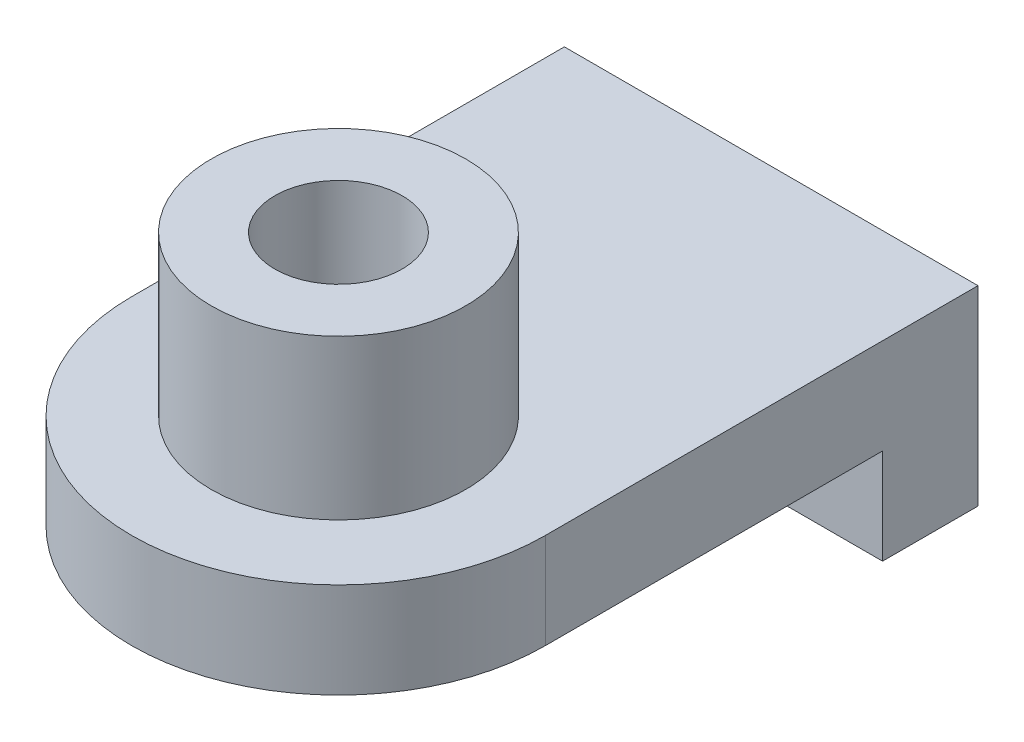
ISO-10303-21;
HEADER;
FILE_DESCRIPTION(('STEP AP214'),'2;1');
FILE_NAME('part.step','',(''),(''),'','','');
FILE_SCHEMA(('AUTOMOTIVE_DESIGN { 1 0 10303 214 1 1 1 1 }'));
ENDSEC;
DATA;
#1=APPLICATION_CONTEXT('core data for automotive mechanical design processes');
#2=APPLICATION_PROTOCOL_DEFINITION('international standard','automotive_design',2000,#1);
#3=PRODUCT_CONTEXT('',#1,'mechanical');
#4=PRODUCT('Part','Part','',(#3));
#5=PRODUCT_RELATED_PRODUCT_CATEGORY('part','',(#4));
#6=PRODUCT_DEFINITION_FORMATION('','',#4);
#7=PRODUCT_DEFINITION_CONTEXT('part definition',#1,'design');
#8=PRODUCT_DEFINITION('design','',#6,#7);
#9=PRODUCT_DEFINITION_SHAPE('','',#8);
#10=(LENGTH_UNIT() NAMED_UNIT(*) SI_UNIT(.MILLI.,.METRE.));
#11=(NAMED_UNIT(*) PLANE_ANGLE_UNIT() SI_UNIT($,.RADIAN.));
#12=(NAMED_UNIT(*) SI_UNIT($,.STERADIAN.) SOLID_ANGLE_UNIT());
#13=UNCERTAINTY_MEASURE_WITH_UNIT(LENGTH_MEASURE(1.E-05),#10,'distance_accuracy_value','');
#14=(GEOMETRIC_REPRESENTATION_CONTEXT(3) GLOBAL_UNCERTAINTY_ASSIGNED_CONTEXT((#13)) GLOBAL_UNIT_ASSIGNED_CONTEXT((#10,
#11,#12)) REPRESENTATION_CONTEXT('',''));
#15=CARTESIAN_POINT('',(0.,0.,0.));
#16=DIRECTION('',(0.,0.,1.));
#17=DIRECTION('',(1.,0.,0.));
#18=AXIS2_PLACEMENT_3D('',#15,#16,#17);
#19=CARTESIAN_POINT('',(0.,40.,0.));
#20=DIRECTION('',(0.,-1.,0.));
#21=DIRECTION('',(0.,0.,-1.));
#22=AXIS2_PLACEMENT_3D('',#19,#20,#21);
#23=CYLINDRICAL_SURFACE('',#22,10.);
#24=CARTESIAN_POINT('',(0.,40.,0.));
#25=DIRECTION('',(0.,1.,0.));
#26=DIRECTION('',(0.,0.,1.));
#27=AXIS2_PLACEMENT_3D('',#24,#25,#26);
#28=CIRCLE('',#27,10.);
#29=CARTESIAN_POINT('',(0.,40.,10.));
#30=VERTEX_POINT('',#29);
#31=EDGE_CURVE('E55',#30,#30,#28,.T.);
#32=ORIENTED_EDGE('',*,*,#31,.T.);
#33=EDGE_LOOP('',(#32));
#34=FACE_BOUND('',#33,.T.);
#35=CARTESIAN_POINT('',(0.,0.,0.));
#36=DIRECTION('',(0.,1.,0.));
#37=DIRECTION('',(0.,0.,1.));
#38=AXIS2_PLACEMENT_3D('',#35,#36,#37);
#39=CIRCLE('',#38,10.);
#40=CARTESIAN_POINT('',(0.,0.,10.));
#41=VERTEX_POINT('',#40);
#42=EDGE_CURVE('E48',#41,#41,#39,.T.);
#43=ORIENTED_EDGE('',*,*,#42,.F.);
#44=EDGE_LOOP('',(#43));
#45=FACE_BOUND('',#44,.T.);
#46=ADVANCED_FACE('F45',(#34,#45),#23,.F.);
#47=CARTESIAN_POINT('',(0.,40.,0.));
#48=DIRECTION('',(0.,-1.,0.));
#49=DIRECTION('',(0.,0.,-1.));
#50=AXIS2_PLACEMENT_3D('',#47,#48,#49);
#51=CYLINDRICAL_SURFACE('',#50,20.);
#52=CARTESIAN_POINT('',(0.,15.,0.));
#53=DIRECTION('',(0.,1.,0.));
#54=DIRECTION('',(0.,0.,1.));
#55=AXIS2_PLACEMENT_3D('',#52,#53,#54);
#56=CIRCLE('',#55,20.);
#57=CARTESIAN_POINT('',(0.,15.,20.));
#58=VERTEX_POINT('',#57);
#59=EDGE_CURVE('E110',#58,#58,#56,.T.);
#60=ORIENTED_EDGE('',*,*,#59,.T.);
#61=EDGE_LOOP('',(#60));
#62=FACE_BOUND('',#61,.T.);
#63=CARTESIAN_POINT('',(0.,40.,0.));
#64=DIRECTION('',(0.,1.,0.));
#65=DIRECTION('',(0.,0.,1.));
#66=AXIS2_PLACEMENT_3D('',#63,#64,#65);
#67=CIRCLE('',#66,20.);
#68=CARTESIAN_POINT('',(0.,40.,20.));
#69=VERTEX_POINT('',#68);
#70=EDGE_CURVE('E11',#69,#69,#67,.T.);
#71=ORIENTED_EDGE('',*,*,#70,.F.);
#72=EDGE_LOOP('',(#71));
#73=FACE_BOUND('',#72,.T.);
#74=ADVANCED_FACE('F133',(#62,#73),#51,.T.);
#75=CARTESIAN_POINT('',(0.,40.,0.));
#76=DIRECTION('',(0.,1.,0.));
#77=DIRECTION('',(0.,0.,1.));
#78=AXIS2_PLACEMENT_3D('',#75,#76,#77);
#79=PLANE('',#78);
#80=ORIENTED_EDGE('',*,*,#31,.F.);
#81=EDGE_LOOP('',(#80));
#82=FACE_BOUND('',#81,.T.);
#83=ORIENTED_EDGE('',*,*,#70,.T.);
#84=EDGE_LOOP('',(#83));
#85=FACE_BOUND('',#84,.T.);
#86=ADVANCED_FACE('F137',(#82,#85),#79,.T.);
#87=CARTESIAN_POINT('',(0.,0.,0.));
#88=DIRECTION('',(0.,1.,0.));
#89=DIRECTION('',(0.,0.,1.));
#90=AXIS2_PLACEMENT_3D('',#87,#88,#89);
#91=PLANE('',#90);
#92=ORIENTED_EDGE('',*,*,#42,.T.);
#93=EDGE_LOOP('',(#92));
#94=FACE_BOUND('',#93,.T.);
#95=DIRECTION('',(0.,0.,-1.));
#96=VECTOR('',#95,1.);
#97=CARTESIAN_POINT('',(-32.5,0.,0.));
#98=LINE('',#97,#96);
#99=CARTESIAN_POINT('',(-32.5,0.,0.));
#100=VERTEX_POINT('',#99);
#101=CARTESIAN_POINT('',(-32.5,0.,-53.));
#102=VERTEX_POINT('',#101);
#103=EDGE_CURVE('E108',#100,#102,#98,.T.);
#104=ORIENTED_EDGE('',*,*,#103,.T.);
#105=DIRECTION('',(1.,0.,0.));
#106=VECTOR('',#105,1.);
#107=CARTESIAN_POINT('',(0.,0.,-53.));
#108=LINE('',#107,#106);
#109=CARTESIAN_POINT('',(32.5,0.,-53.));
#110=VERTEX_POINT('',#109);
#111=EDGE_CURVE('E87',#102,#110,#108,.T.);
#112=ORIENTED_EDGE('',*,*,#111,.T.);
#113=DIRECTION('',(0.,0.,-1.));
#114=VECTOR('',#113,1.);
#115=CARTESIAN_POINT('',(32.5,0.,0.));
#116=LINE('',#115,#114);
#117=CARTESIAN_POINT('',(32.5,0.,0.));
#118=VERTEX_POINT('',#117);
#119=EDGE_CURVE('E78',#118,#110,#116,.T.);
#120=ORIENTED_EDGE('',*,*,#119,.F.);
#121=CARTESIAN_POINT('',(0.,0.,0.));
#122=DIRECTION('',(0.,1.,0.));
#123=DIRECTION('',(0.,0.,1.));
#124=AXIS2_PLACEMENT_3D('',#121,#122,#123);
#125=CIRCLE('',#124,32.5);
#126=EDGE_CURVE('E103',#100,#118,#125,.T.);
#127=ORIENTED_EDGE('',*,*,#126,.F.);
#128=EDGE_LOOP('',(#104,#112,#120,#127));
#129=FACE_BOUND('',#128,.T.);
#130=ADVANCED_FACE('F106',(#94,#129),#91,.F.);
#131=CARTESIAN_POINT('',(-32.5,15.,0.));
#132=DIRECTION('',(-1.,0.,0.));
#133=DIRECTION('',(0.,0.,1.));
#134=AXIS2_PLACEMENT_3D('',#131,#132,#133);
#135=PLANE('',#134);
#136=ORIENTED_EDGE('',*,*,#103,.F.);
#137=DIRECTION('',(0.,-1.,0.));
#138=VECTOR('',#137,1.);
#139=CARTESIAN_POINT('',(-32.5,15.,0.));
#140=LINE('',#139,#138);
#141=CARTESIAN_POINT('',(-32.5,15.,0.));
#142=VERTEX_POINT('',#141);
#143=EDGE_CURVE('E120',#142,#100,#140,.T.);
#144=ORIENTED_EDGE('',*,*,#143,.F.);
#145=DIRECTION('',(0.,0.,-1.));
#146=VECTOR('',#145,1.);
#147=CARTESIAN_POINT('',(-32.5,15.,0.));
#148=LINE('',#147,#146);
#149=CARTESIAN_POINT('',(-32.5,15.,-68.));
#150=VERTEX_POINT('',#149);
#151=EDGE_CURVE('E114',#142,#150,#148,.T.);
#152=ORIENTED_EDGE('',*,*,#151,.T.);
#153=DIRECTION('',(0.,1.,0.));
#154=VECTOR('',#153,1.);
#155=CARTESIAN_POINT('',(-32.5,-15.,-68.));
#156=LINE('',#155,#154);
#157=CARTESIAN_POINT('',(-32.5,-15.,-68.));
#158=VERTEX_POINT('',#157);
#159=EDGE_CURVE('E198',#158,#150,#156,.T.);
#160=ORIENTED_EDGE('',*,*,#159,.F.);
#161=DIRECTION('',(0.,0.,-1.));
#162=VECTOR('',#161,1.);
#163=CARTESIAN_POINT('',(-32.5,-15.,0.));
#164=LINE('',#163,#162);
#165=CARTESIAN_POINT('',(-32.5,-15.,-53.));
#166=VERTEX_POINT('',#165);
#167=EDGE_CURVE('E96',#166,#158,#164,.T.);
#168=ORIENTED_EDGE('',*,*,#167,.F.);
#169=DIRECTION('',(0.,1.,0.));
#170=VECTOR('',#169,1.);
#171=CARTESIAN_POINT('',(-32.5,-15.,-53.));
#172=LINE('',#171,#170);
#173=EDGE_CURVE('E195',#166,#102,#172,.T.);
#174=ORIENTED_EDGE('',*,*,#173,.T.);
#175=EDGE_LOOP('',(#136,#144,#152,#160,#168,#174));
#176=FACE_BOUND('',#175,.T.);
#177=ADVANCED_FACE('F147',(#176),#135,.T.);
#178=CARTESIAN_POINT('',(0.,15.,0.));
#179=DIRECTION('',(0.,-1.,0.));
#180=DIRECTION('',(0.,0.,-1.));
#181=AXIS2_PLACEMENT_3D('',#178,#179,#180);
#182=CYLINDRICAL_SURFACE('',#181,32.5);
#183=ORIENTED_EDGE('',*,*,#126,.T.);
#184=DIRECTION('',(0.,-1.,0.));
#185=VECTOR('',#184,1.);
#186=CARTESIAN_POINT('',(32.5,15.,0.));
#187=LINE('',#186,#185);
#188=CARTESIAN_POINT('',(32.5,15.,0.));
#189=VERTEX_POINT('',#188);
#190=EDGE_CURVE('E100',#189,#118,#187,.T.);
#191=ORIENTED_EDGE('',*,*,#190,.F.);
#192=CARTESIAN_POINT('',(0.,15.,0.));
#193=DIRECTION('',(0.,1.,0.));
#194=DIRECTION('',(0.,0.,1.));
#195=AXIS2_PLACEMENT_3D('',#192,#193,#194);
#196=CIRCLE('',#195,32.5);
#197=EDGE_CURVE('E207',#142,#189,#196,.T.);
#198=ORIENTED_EDGE('',*,*,#197,.F.);
#199=ORIENTED_EDGE('',*,*,#143,.T.);
#200=EDGE_LOOP('',(#183,#191,#198,#199));
#201=FACE_BOUND('',#200,.T.);
#202=ADVANCED_FACE('F151',(#201),#182,.T.);
#203=CARTESIAN_POINT('',(32.5,15.,0.));
#204=DIRECTION('',(-1.,0.,0.));
#205=DIRECTION('',(0.,0.,1.));
#206=AXIS2_PLACEMENT_3D('',#203,#204,#205);
#207=PLANE('',#206);
#208=ORIENTED_EDGE('',*,*,#119,.T.);
#209=DIRECTION('',(0.,1.,0.));
#210=VECTOR('',#209,1.);
#211=CARTESIAN_POINT('',(32.5,-15.,-53.));
#212=LINE('',#211,#210);
#213=CARTESIAN_POINT('',(32.5,-15.,-53.));
#214=VERTEX_POINT('',#213);
#215=EDGE_CURVE('E84',#214,#110,#212,.T.);
#216=ORIENTED_EDGE('',*,*,#215,.F.);
#217=DIRECTION('',(0.,0.,-1.));
#218=VECTOR('',#217,1.);
#219=CARTESIAN_POINT('',(32.5,-15.,0.));
#220=LINE('',#219,#218);
#221=CARTESIAN_POINT('',(32.5,-15.,-68.));
#222=VERTEX_POINT('',#221);
#223=EDGE_CURVE('E179',#214,#222,#220,.T.);
#224=ORIENTED_EDGE('',*,*,#223,.T.);
#225=DIRECTION('',(0.,1.,0.));
#226=VECTOR('',#225,1.);
#227=CARTESIAN_POINT('',(32.5,-15.,-68.));
#228=LINE('',#227,#226);
#229=CARTESIAN_POINT('',(32.5,15.,-68.));
#230=VERTEX_POINT('',#229);
#231=EDGE_CURVE('E95',#222,#230,#228,.T.);
#232=ORIENTED_EDGE('',*,*,#231,.T.);
#233=DIRECTION('',(0.,0.,-1.));
#234=VECTOR('',#233,1.);
#235=CARTESIAN_POINT('',(32.5,15.,0.));
#236=LINE('',#235,#234);
#237=EDGE_CURVE('E63',#189,#230,#236,.T.);
#238=ORIENTED_EDGE('',*,*,#237,.F.);
#239=ORIENTED_EDGE('',*,*,#190,.T.);
#240=EDGE_LOOP('',(#208,#216,#224,#232,#238,#239));
#241=FACE_BOUND('',#240,.T.);
#242=ADVANCED_FACE('F98',(#241),#207,.F.);
#243=CARTESIAN_POINT('',(0.,15.,0.));
#244=DIRECTION('',(0.,1.,0.));
#245=DIRECTION('',(0.,0.,1.));
#246=AXIS2_PLACEMENT_3D('',#243,#244,#245);
#247=PLANE('',#246);
#248=ORIENTED_EDGE('',*,*,#59,.F.);
#249=EDGE_LOOP('',(#248));
#250=FACE_BOUND('',#249,.T.);
#251=ORIENTED_EDGE('',*,*,#151,.F.);
#252=ORIENTED_EDGE('',*,*,#197,.T.);
#253=ORIENTED_EDGE('',*,*,#237,.T.);
#254=DIRECTION('',(1.,0.,0.));
#255=VECTOR('',#254,1.);
#256=CARTESIAN_POINT('',(0.,15.,-68.));
#257=LINE('',#256,#255);
#258=EDGE_CURVE('E182',#150,#230,#257,.T.);
#259=ORIENTED_EDGE('',*,*,#258,.F.);
#260=EDGE_LOOP('',(#251,#252,#253,#259));
#261=FACE_BOUND('',#260,.T.);
#262=ADVANCED_FACE('F158',(#250,#261),#247,.T.);
#263=CARTESIAN_POINT('',(0.,-15.,-53.));
#264=DIRECTION('',(0.,0.,1.));
#265=DIRECTION('',(1.,0.,0.));
#266=AXIS2_PLACEMENT_3D('',#263,#264,#265);
#267=PLANE('',#266);
#268=ORIENTED_EDGE('',*,*,#111,.F.);
#269=ORIENTED_EDGE('',*,*,#173,.F.);
#270=DIRECTION('',(1.,0.,0.));
#271=VECTOR('',#270,1.);
#272=CARTESIAN_POINT('',(0.,-15.,-53.));
#273=LINE('',#272,#271);
#274=EDGE_CURVE('E91',#166,#214,#273,.T.);
#275=ORIENTED_EDGE('',*,*,#274,.T.);
#276=ORIENTED_EDGE('',*,*,#215,.T.);
#277=EDGE_LOOP('',(#268,#269,#275,#276));
#278=FACE_BOUND('',#277,.T.);
#279=ADVANCED_FACE('F85',(#278),#267,.T.);
#280=CARTESIAN_POINT('',(0.,-15.,-68.));
#281=DIRECTION('',(0.,0.,1.));
#282=DIRECTION('',(1.,0.,0.));
#283=AXIS2_PLACEMENT_3D('',#280,#281,#282);
#284=PLANE('',#283);
#285=ORIENTED_EDGE('',*,*,#159,.T.);
#286=ORIENTED_EDGE('',*,*,#258,.T.);
#287=ORIENTED_EDGE('',*,*,#231,.F.);
#288=DIRECTION('',(1.,0.,0.));
#289=VECTOR('',#288,1.);
#290=CARTESIAN_POINT('',(0.,-15.,-68.));
#291=LINE('',#290,#289);
#292=EDGE_CURVE('E186',#158,#222,#291,.T.);
#293=ORIENTED_EDGE('',*,*,#292,.F.);
#294=EDGE_LOOP('',(#285,#286,#287,#293));
#295=FACE_BOUND('',#294,.T.);
#296=ADVANCED_FACE('F164',(#295),#284,.F.);
#297=CARTESIAN_POINT('',(0.,-15.,0.));
#298=DIRECTION('',(0.,1.,0.));
#299=DIRECTION('',(0.,0.,1.));
#300=AXIS2_PLACEMENT_3D('',#297,#298,#299);
#301=PLANE('',#300);
#302=ORIENTED_EDGE('',*,*,#274,.F.);
#303=ORIENTED_EDGE('',*,*,#167,.T.);
#304=ORIENTED_EDGE('',*,*,#292,.T.);
#305=ORIENTED_EDGE('',*,*,#223,.F.);
#306=EDGE_LOOP('',(#302,#303,#304,#305));
#307=FACE_BOUND('',#306,.T.);
#308=ADVANCED_FACE('F167',(#307),#301,.F.);
#309=CLOSED_SHELL('',(#46,#74,#86,#130,#177,#202,#242,#262,#279,#296,#308));
#310=MANIFOLD_SOLID_BREP('B2',#309);
#311=ADVANCED_BREP_SHAPE_REPRESENTATION('',(#18,#310),#14);
#312=SHAPE_DEFINITION_REPRESENTATION(#9,#311);
ENDSEC;
END-ISO-10303-21;
